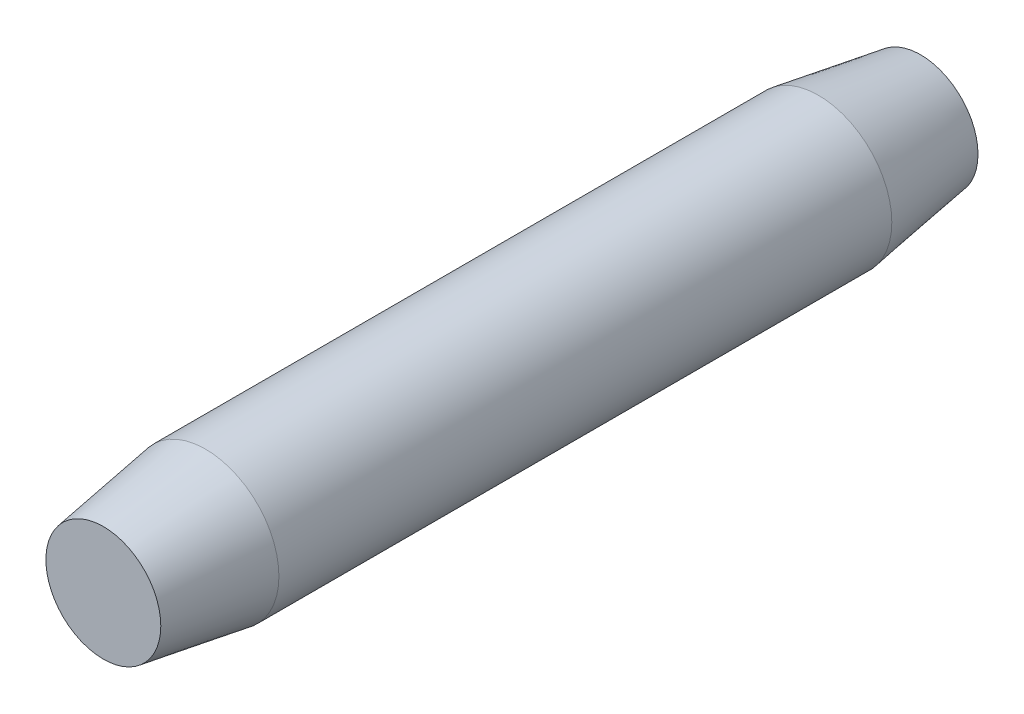
ISO-10303-21;
HEADER;
FILE_DESCRIPTION(('STEP AP214'),'2;1');
FILE_NAME('part.step','',(''),(''),'','','');
FILE_SCHEMA(('AUTOMOTIVE_DESIGN { 1 0 10303 214 1 1 1 1 }'));
ENDSEC;
DATA;
#1=APPLICATION_CONTEXT('core data for automotive mechanical design processes');
#2=APPLICATION_PROTOCOL_DEFINITION('international standard','automotive_design',2000,#1);
#3=PRODUCT_CONTEXT('',#1,'mechanical');
#4=PRODUCT('Part','Part','',(#3));
#5=PRODUCT_RELATED_PRODUCT_CATEGORY('part','',(#4));
#6=PRODUCT_DEFINITION_FORMATION('','',#4);
#7=PRODUCT_DEFINITION_CONTEXT('part definition',#1,'design');
#8=PRODUCT_DEFINITION('design','',#6,#7);
#9=PRODUCT_DEFINITION_SHAPE('','',#8);
#10=(LENGTH_UNIT() NAMED_UNIT(*) SI_UNIT(.MILLI.,.METRE.));
#11=(NAMED_UNIT(*) PLANE_ANGLE_UNIT() SI_UNIT($,.RADIAN.));
#12=(NAMED_UNIT(*) SI_UNIT($,.STERADIAN.) SOLID_ANGLE_UNIT());
#13=UNCERTAINTY_MEASURE_WITH_UNIT(LENGTH_MEASURE(1.E-05),#10,'distance_accuracy_value','');
#14=(GEOMETRIC_REPRESENTATION_CONTEXT(3) GLOBAL_UNCERTAINTY_ASSIGNED_CONTEXT((#13)) GLOBAL_UNIT_ASSIGNED_CONTEXT((#10,
#11,#12)) REPRESENTATION_CONTEXT('',''));
#15=CARTESIAN_POINT('',(0.,0.,0.));
#16=DIRECTION('',(0.,0.,1.));
#17=DIRECTION('',(1.,0.,0.));
#18=AXIS2_PLACEMENT_3D('',#15,#16,#17);
#19=CARTESIAN_POINT('',(0.,0.,101.6));
#20=DIRECTION('',(0.,0.,-1.));
#21=DIRECTION('',(-1.,0.,0.));
#22=AXIS2_PLACEMENT_3D('',#19,#20,#21);
#23=CYLINDRICAL_SURFACE('',#22,18.25625);
#24=CARTESIAN_POINT('',(0.,0.,-76.1999999999989));
#25=DIRECTION('',(0.,0.,1.));
#26=DIRECTION('',(1.,0.,0.));
#27=AXIS2_PLACEMENT_3D('',#24,#25,#26);
#28=CIRCLE('',#27,18.25625);
#29=CARTESIAN_POINT('',(18.25625,0.,-76.1999999999989));
#30=VERTEX_POINT('',#29);
#31=EDGE_CURVE('E37',#30,#30,#28,.T.);
#32=ORIENTED_EDGE('',*,*,#31,.T.);
#33=EDGE_LOOP('',(#32));
#34=FACE_BOUND('',#33,.T.);
#35=CARTESIAN_POINT('',(0.,0.,76.1999999999998));
#36=DIRECTION('',(0.,0.,1.));
#37=DIRECTION('',(1.,0.,0.));
#38=AXIS2_PLACEMENT_3D('',#35,#36,#37);
#39=CIRCLE('',#38,18.25625);
#40=CARTESIAN_POINT('',(18.25625,0.,76.1999999999998));
#41=VERTEX_POINT('',#40);
#42=EDGE_CURVE('E41',#41,#41,#39,.F.);
#43=ORIENTED_EDGE('',*,*,#42,.T.);
#44=EDGE_LOOP('',(#43));
#45=FACE_BOUND('',#44,.T.);
#46=ADVANCED_FACE('F30',(#34,#45),#23,.T.);
#47=CARTESIAN_POINT('',(0.,0.,101.6));
#48=DIRECTION('',(0.,0.,1.));
#49=DIRECTION('',(1.,0.,0.));
#50=AXIS2_PLACEMENT_3D('',#47,#48,#49);
#51=PLANE('',#50);
#52=CARTESIAN_POINT('',(0.,0.,101.6));
#53=DIRECTION('',(0.,0.,1.));
#54=DIRECTION('',(1.,0.,0.));
#55=AXIS2_PLACEMENT_3D('',#52,#53,#54);
#56=CIRCLE('',#55,14.2875000000001);
#57=CARTESIAN_POINT('',(14.2875000000001,0.,101.6));
#58=VERTEX_POINT('',#57);
#59=EDGE_CURVE('E45',#58,#58,#56,.T.);
#60=ORIENTED_EDGE('',*,*,#59,.T.);
#61=EDGE_LOOP('',(#60));
#62=FACE_BOUND('',#61,.T.);
#63=ADVANCED_FACE('F51',(#62),#51,.T.);
#64=CARTESIAN_POINT('',(0.,0.,-101.6));
#65=DIRECTION('',(0.,0.,1.));
#66=DIRECTION('',(1.,0.,0.));
#67=AXIS2_PLACEMENT_3D('',#64,#65,#66);
#68=PLANE('',#67);
#69=CARTESIAN_POINT('',(0.,0.,-101.6));
#70=DIRECTION('',(0.,0.,1.));
#71=DIRECTION('',(1.,0.,0.));
#72=AXIS2_PLACEMENT_3D('',#69,#70,#71);
#73=CIRCLE('',#72,14.2874999999999);
#74=CARTESIAN_POINT('',(14.2874999999999,0.,-101.6));
#75=VERTEX_POINT('',#74);
#76=EDGE_CURVE('E10',#75,#75,#73,.F.);
#77=ORIENTED_EDGE('',*,*,#76,.T.);
#78=EDGE_LOOP('',(#77));
#79=FACE_BOUND('',#78,.T.);
#80=ADVANCED_FACE('F55',(#79),#68,.F.);
#81=CARTESIAN_POINT('',(0.,0.,101.6));
#82=DIRECTION('',(0.,0.,-1.));
#83=DIRECTION('',(-1.,0.,0.));
#84=AXIS2_PLACEMENT_3D('',#81,#82,#83);
#85=CONICAL_SURFACE('',#84,14.2875000000001,0.154996741923938);
#86=ORIENTED_EDGE('',*,*,#42,.F.);
#87=EDGE_LOOP('',(#86));
#88=FACE_BOUND('',#87,.T.);
#89=ORIENTED_EDGE('',*,*,#59,.F.);
#90=EDGE_LOOP('',(#89));
#91=FACE_BOUND('',#90,.T.);
#92=ADVANCED_FACE('F53',(#88,#91),#85,.T.);
#93=CARTESIAN_POINT('',(0.,0.,-76.1999999999989));
#94=DIRECTION('',(0.,0.,1.));
#95=DIRECTION('',(1.,0.,0.));
#96=AXIS2_PLACEMENT_3D('',#93,#94,#95);
#97=CONICAL_SURFACE('',#96,18.25625,0.154996741923938);
#98=ORIENTED_EDGE('',*,*,#76,.F.);
#99=EDGE_LOOP('',(#98));
#100=FACE_BOUND('',#99,.T.);
#101=ORIENTED_EDGE('',*,*,#31,.F.);
#102=EDGE_LOOP('',(#101));
#103=FACE_BOUND('',#102,.T.);
#104=ADVANCED_FACE('F32',(#100,#103),#97,.T.);
#105=CLOSED_SHELL('',(#46,#63,#80,#92,#104));
#106=MANIFOLD_SOLID_BREP('B2',#105);
#107=ADVANCED_BREP_SHAPE_REPRESENTATION('',(#18,#106),#14);
#108=SHAPE_DEFINITION_REPRESENTATION(#9,#107);
ENDSEC;
END-ISO-10303-21;
